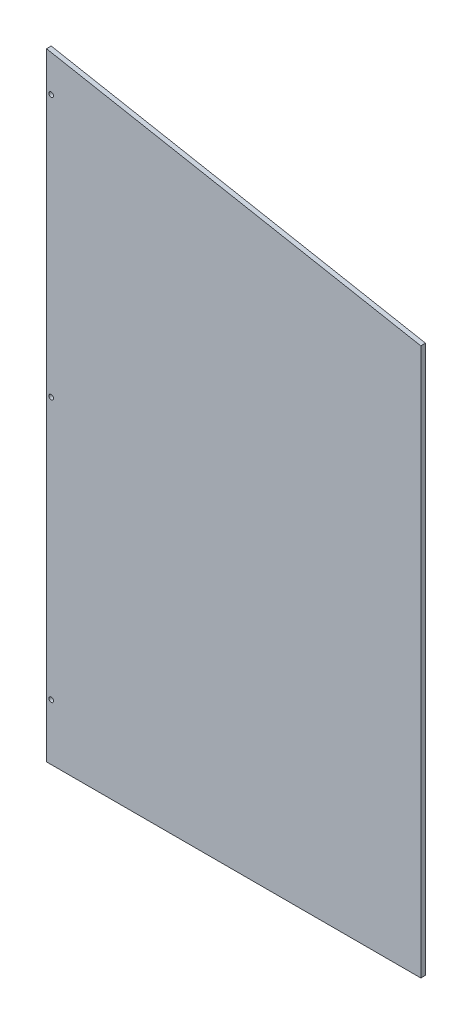
ISO-10303-21;
HEADER;
FILE_DESCRIPTION(('STEP AP214'),'2;1');
FILE_NAME('part.step','',(''),(''),'','','');
FILE_SCHEMA(('AUTOMOTIVE_DESIGN { 1 0 10303 214 1 1 1 1 }'));
ENDSEC;
DATA;
#1=APPLICATION_CONTEXT('core data for automotive mechanical design processes');
#2=APPLICATION_PROTOCOL_DEFINITION('international standard','automotive_design',2000,#1);
#3=PRODUCT_CONTEXT('',#1,'mechanical');
#4=PRODUCT('Part','Part','',(#3));
#5=PRODUCT_RELATED_PRODUCT_CATEGORY('part','',(#4));
#6=PRODUCT_DEFINITION_FORMATION('','',#4);
#7=PRODUCT_DEFINITION_CONTEXT('part definition',#1,'design');
#8=PRODUCT_DEFINITION('design','',#6,#7);
#9=PRODUCT_DEFINITION_SHAPE('','',#8);
#10=(LENGTH_UNIT() NAMED_UNIT(*) SI_UNIT(.MILLI.,.METRE.));
#11=(NAMED_UNIT(*) PLANE_ANGLE_UNIT() SI_UNIT($,.RADIAN.));
#12=(NAMED_UNIT(*) SI_UNIT($,.STERADIAN.) SOLID_ANGLE_UNIT());
#13=UNCERTAINTY_MEASURE_WITH_UNIT(LENGTH_MEASURE(1.E-05),#10,'distance_accuracy_value','');
#14=(GEOMETRIC_REPRESENTATION_CONTEXT(3) GLOBAL_UNCERTAINTY_ASSIGNED_CONTEXT((#13)) GLOBAL_UNIT_ASSIGNED_CONTEXT((#10,
#11,#12)) REPRESENTATION_CONTEXT('',''));
#15=CARTESIAN_POINT('',(0.,0.,0.));
#16=DIRECTION('',(0.,0.,1.));
#17=DIRECTION('',(1.,0.,0.));
#18=AXIS2_PLACEMENT_3D('',#15,#16,#17);
#19=CARTESIAN_POINT('',(0.,0.,0.));
#20=DIRECTION('',(0.,0.,1.));
#21=DIRECTION('',(1.,0.,0.));
#22=AXIS2_PLACEMENT_3D('',#19,#20,#21);
#23=PLANE('',#22);
#24=CARTESIAN_POINT('',(6.35,787.4,0.));
#25=DIRECTION('',(0.,0.,-1.));
#26=DIRECTION('',(-1.,0.,0.));
#27=AXIS2_PLACEMENT_3D('',#24,#25,#26);
#28=CIRCLE('',#27,3.175);
#29=CARTESIAN_POINT('',(3.175,787.4,0.));
#30=VERTEX_POINT('',#29);
#31=EDGE_CURVE('E87',#30,#30,#28,.F.);
#32=ORIENTED_EDGE('',*,*,#31,.T.);
#33=EDGE_LOOP('',(#32));
#34=FACE_BOUND('',#33,.T.);
#35=CARTESIAN_POINT('',(6.35,76.2,0.));
#36=DIRECTION('',(0.,0.,-1.));
#37=DIRECTION('',(-1.,0.,0.));
#38=AXIS2_PLACEMENT_3D('',#35,#36,#37);
#39=CIRCLE('',#38,3.175);
#40=CARTESIAN_POINT('',(3.175,76.2,0.));
#41=VERTEX_POINT('',#40);
#42=EDGE_CURVE('E90',#41,#41,#39,.F.);
#43=ORIENTED_EDGE('',*,*,#42,.T.);
#44=EDGE_LOOP('',(#43));
#45=FACE_BOUND('',#44,.T.);
#46=CARTESIAN_POINT('',(6.35,431.8,0.));
#47=DIRECTION('',(0.,0.,-1.));
#48=DIRECTION('',(-1.,0.,0.));
#49=AXIS2_PLACEMENT_3D('',#46,#47,#48);
#50=CIRCLE('',#49,3.175);
#51=CARTESIAN_POINT('',(3.175,431.8,0.));
#52=VERTEX_POINT('',#51);
#53=EDGE_CURVE('E20',#52,#52,#50,.F.);
#54=ORIENTED_EDGE('',*,*,#53,.T.);
#55=EDGE_LOOP('',(#54));
#56=FACE_BOUND('',#55,.T.);
#57=DIRECTION('',(1.,0.,0.));
#58=VECTOR('',#57,1.);
#59=CARTESIAN_POINT('',(0.,0.,0.));
#60=LINE('',#59,#58);
#61=CARTESIAN_POINT('',(0.,0.,0.));
#62=VERTEX_POINT('',#61);
#63=CARTESIAN_POINT('',(508.,0.,0.));
#64=VERTEX_POINT('',#63);
#65=EDGE_CURVE('E56',#62,#64,#60,.T.);
#66=ORIENTED_EDGE('',*,*,#65,.F.);
#67=DIRECTION('',(0.,1.,0.));
#68=VECTOR('',#67,1.);
#69=CARTESIAN_POINT('',(0.,838.2,0.));
#70=LINE('',#69,#68);
#71=CARTESIAN_POINT('',(4.44089209850063E-13,838.200000000002,0.));
#72=VERTEX_POINT('',#71);
#73=EDGE_CURVE('E61',#72,#62,#70,.F.);
#74=ORIENTED_EDGE('',*,*,#73,.F.);
#75=DIRECTION('',(0.982872186934319,-0.184288535050203,0.));
#76=VECTOR('',#75,1.);
#77=CARTESIAN_POINT('',(508.,742.95,0.));
#78=LINE('',#77,#76);
#79=CARTESIAN_POINT('',(508.,742.95,0.));
#80=VERTEX_POINT('',#79);
#81=EDGE_CURVE('E97',#72,#80,#78,.T.);
#82=ORIENTED_EDGE('',*,*,#81,.T.);
#83=DIRECTION('',(0.,1.,0.));
#84=VECTOR('',#83,1.);
#85=CARTESIAN_POINT('',(508.,0.,0.));
#86=LINE('',#85,#84);
#87=EDGE_CURVE('E70',#64,#80,#86,.T.);
#88=ORIENTED_EDGE('',*,*,#87,.F.);
#89=EDGE_LOOP('',(#66,#74,#82,#88));
#90=FACE_BOUND('',#89,.T.);
#91=ADVANCED_FACE('F17',(#34,#45,#56,#90),#23,.F.);
#92=CARTESIAN_POINT('',(0.,838.2,0.));
#93=DIRECTION('',(-1.,0.,0.));
#94=DIRECTION('',(0.,0.,1.));
#95=AXIS2_PLACEMENT_3D('',#92,#93,#94);
#96=PLANE('',#95);
#97=DIRECTION('',(0.,1.,0.));
#98=VECTOR('',#97,1.);
#99=CARTESIAN_POINT('',(0.,0.,6.35));
#100=LINE('',#99,#98);
#101=CARTESIAN_POINT('',(4.71844785465692E-13,838.200000000002,6.35));
#102=VERTEX_POINT('',#101);
#103=CARTESIAN_POINT('',(0.,0.,6.35));
#104=VERTEX_POINT('',#103);
#105=EDGE_CURVE('E89',#102,#104,#100,.F.);
#106=ORIENTED_EDGE('',*,*,#105,.F.);
#107=DIRECTION('',(0.,0.,1.));
#108=VECTOR('',#107,1.);
#109=CARTESIAN_POINT('',(1.77635683940025E-12,838.200000000009,0.));
#110=LINE('',#109,#108);
#111=EDGE_CURVE('E66',#102,#72,#110,.F.);
#112=ORIENTED_EDGE('',*,*,#111,.T.);
#113=ORIENTED_EDGE('',*,*,#73,.T.);
#114=DIRECTION('',(0.,0.,-1.));
#115=VECTOR('',#114,1.);
#116=CARTESIAN_POINT('',(0.,0.,0.));
#117=LINE('',#116,#115);
#118=EDGE_CURVE('E63',#104,#62,#117,.T.);
#119=ORIENTED_EDGE('',*,*,#118,.F.);
#120=EDGE_LOOP('',(#106,#112,#113,#119));
#121=FACE_BOUND('',#120,.T.);
#122=ADVANCED_FACE('F62',(#121),#96,.T.);
#123=CARTESIAN_POINT('',(0.,0.,0.));
#124=DIRECTION('',(0.,-1.,0.));
#125=DIRECTION('',(0.,0.,-1.));
#126=AXIS2_PLACEMENT_3D('',#123,#124,#125);
#127=PLANE('',#126);
#128=ORIENTED_EDGE('',*,*,#118,.T.);
#129=ORIENTED_EDGE('',*,*,#65,.T.);
#130=DIRECTION('',(0.,0.,-1.));
#131=VECTOR('',#130,1.);
#132=CARTESIAN_POINT('',(508.,0.,0.));
#133=LINE('',#132,#131);
#134=CARTESIAN_POINT('',(508.,0.,6.35));
#135=VERTEX_POINT('',#134);
#136=EDGE_CURVE('E72',#135,#64,#133,.T.);
#137=ORIENTED_EDGE('',*,*,#136,.F.);
#138=DIRECTION('',(1.,0.,0.));
#139=VECTOR('',#138,1.);
#140=CARTESIAN_POINT('',(0.,0.,6.35));
#141=LINE('',#140,#139);
#142=EDGE_CURVE('E76',#104,#135,#141,.T.);
#143=ORIENTED_EDGE('',*,*,#142,.F.);
#144=EDGE_LOOP('',(#128,#129,#137,#143));
#145=FACE_BOUND('',#144,.T.);
#146=ADVANCED_FACE('F74',(#145),#127,.T.);
#147=CARTESIAN_POINT('',(508.,0.,0.));
#148=DIRECTION('',(1.,0.,0.));
#149=DIRECTION('',(0.,0.,-1.));
#150=AXIS2_PLACEMENT_3D('',#147,#148,#149);
#151=PLANE('',#150);
#152=ORIENTED_EDGE('',*,*,#87,.T.);
#153=DIRECTION('',(0.,0.,1.));
#154=VECTOR('',#153,1.);
#155=CARTESIAN_POINT('',(508.,742.95,0.));
#156=LINE('',#155,#154);
#157=CARTESIAN_POINT('',(508.,742.95,6.35));
#158=VERTEX_POINT('',#157);
#159=EDGE_CURVE('E35',#80,#158,#156,.T.);
#160=ORIENTED_EDGE('',*,*,#159,.T.);
#161=DIRECTION('',(0.,1.,0.));
#162=VECTOR('',#161,1.);
#163=CARTESIAN_POINT('',(508.,0.,6.35));
#164=LINE('',#163,#162);
#165=EDGE_CURVE('E106',#135,#158,#164,.T.);
#166=ORIENTED_EDGE('',*,*,#165,.F.);
#167=ORIENTED_EDGE('',*,*,#136,.T.);
#168=EDGE_LOOP('',(#152,#160,#166,#167));
#169=FACE_BOUND('',#168,.T.);
#170=ADVANCED_FACE('F104',(#169),#151,.T.);
#171=CARTESIAN_POINT('',(508.,742.95,0.));
#172=DIRECTION('',(-0.184288535050203,-0.982872186934319,0.));
#173=DIRECTION('',(0.982872186934319,-0.184288535050203,0.));
#174=AXIS2_PLACEMENT_3D('',#171,#172,#173);
#175=PLANE('',#174);
#176=ORIENTED_EDGE('',*,*,#81,.F.);
#177=ORIENTED_EDGE('',*,*,#111,.F.);
#178=DIRECTION('',(-0.982872186934322,0.184288535050185,0.));
#179=VECTOR('',#178,1.);
#180=CARTESIAN_POINT('',(508.,742.95,6.35));
#181=LINE('',#180,#179);
#182=EDGE_CURVE('E86',#158,#102,#181,.T.);
#183=ORIENTED_EDGE('',*,*,#182,.F.);
#184=ORIENTED_EDGE('',*,*,#159,.F.);
#185=EDGE_LOOP('',(#176,#177,#183,#184));
#186=FACE_BOUND('',#185,.T.);
#187=ADVANCED_FACE('F113',(#186),#175,.F.);
#188=CARTESIAN_POINT('',(6.35,431.8,6.35));
#189=DIRECTION('',(0.,0.,-1.));
#190=DIRECTION('',(-1.,0.,0.));
#191=AXIS2_PLACEMENT_3D('',#188,#189,#190);
#192=CYLINDRICAL_SURFACE('',#191,3.175);
#193=CARTESIAN_POINT('',(6.35,431.8,6.35));
#194=DIRECTION('',(0.,0.,-1.));
#195=DIRECTION('',(-1.,0.,0.));
#196=AXIS2_PLACEMENT_3D('',#193,#194,#195);
#197=CIRCLE('',#196,3.175);
#198=CARTESIAN_POINT('',(3.175,431.8,6.35));
#199=VERTEX_POINT('',#198);
#200=EDGE_CURVE('E83',#199,#199,#197,.T.);
#201=ORIENTED_EDGE('',*,*,#200,.F.);
#202=EDGE_LOOP('',(#201));
#203=FACE_BOUND('',#202,.T.);
#204=ORIENTED_EDGE('',*,*,#53,.F.);
#205=EDGE_LOOP('',(#204));
#206=FACE_BOUND('',#205,.T.);
#207=ADVANCED_FACE('F115',(#203,#206),#192,.F.);
#208=CARTESIAN_POINT('',(6.35,76.2,6.35));
#209=DIRECTION('',(0.,0.,-1.));
#210=DIRECTION('',(-1.,0.,0.));
#211=AXIS2_PLACEMENT_3D('',#208,#209,#210);
#212=CYLINDRICAL_SURFACE('',#211,3.175);
#213=CARTESIAN_POINT('',(6.35,76.2,6.35));
#214=DIRECTION('',(0.,0.,-1.));
#215=DIRECTION('',(-1.,0.,0.));
#216=AXIS2_PLACEMENT_3D('',#213,#214,#215);
#217=CIRCLE('',#216,3.175);
#218=CARTESIAN_POINT('',(3.175,76.2,6.35));
#219=VERTEX_POINT('',#218);
#220=EDGE_CURVE('E26',#219,#219,#217,.T.);
#221=ORIENTED_EDGE('',*,*,#220,.F.);
#222=EDGE_LOOP('',(#221));
#223=FACE_BOUND('',#222,.T.);
#224=ORIENTED_EDGE('',*,*,#42,.F.);
#225=EDGE_LOOP('',(#224));
#226=FACE_BOUND('',#225,.T.);
#227=ADVANCED_FACE('F122',(#223,#226),#212,.F.);
#228=CARTESIAN_POINT('',(6.35,787.4,6.35));
#229=DIRECTION('',(0.,0.,-1.));
#230=DIRECTION('',(-1.,0.,0.));
#231=AXIS2_PLACEMENT_3D('',#228,#229,#230);
#232=CYLINDRICAL_SURFACE('',#231,3.175);
#233=CARTESIAN_POINT('',(6.35,787.4,6.35));
#234=DIRECTION('',(0.,0.,-1.));
#235=DIRECTION('',(-1.,0.,0.));
#236=AXIS2_PLACEMENT_3D('',#233,#234,#235);
#237=CIRCLE('',#236,3.175);
#238=CARTESIAN_POINT('',(3.175,787.4,6.35));
#239=VERTEX_POINT('',#238);
#240=EDGE_CURVE('E11',#239,#239,#237,.T.);
#241=ORIENTED_EDGE('',*,*,#240,.F.);
#242=EDGE_LOOP('',(#241));
#243=FACE_BOUND('',#242,.T.);
#244=ORIENTED_EDGE('',*,*,#31,.F.);
#245=EDGE_LOOP('',(#244));
#246=FACE_BOUND('',#245,.T.);
#247=ADVANCED_FACE('F127',(#243,#246),#232,.F.);
#248=CARTESIAN_POINT('',(0.,0.,6.35));
#249=DIRECTION('',(0.,0.,1.));
#250=DIRECTION('',(1.,0.,0.));
#251=AXIS2_PLACEMENT_3D('',#248,#249,#250);
#252=PLANE('',#251);
#253=ORIENTED_EDGE('',*,*,#240,.T.);
#254=EDGE_LOOP('',(#253));
#255=FACE_BOUND('',#254,.T.);
#256=ORIENTED_EDGE('',*,*,#220,.T.);
#257=EDGE_LOOP('',(#256));
#258=FACE_BOUND('',#257,.T.);
#259=ORIENTED_EDGE('',*,*,#200,.T.);
#260=EDGE_LOOP('',(#259));
#261=FACE_BOUND('',#260,.T.);
#262=ORIENTED_EDGE('',*,*,#165,.T.);
#263=ORIENTED_EDGE('',*,*,#182,.T.);
#264=ORIENTED_EDGE('',*,*,#105,.T.);
#265=ORIENTED_EDGE('',*,*,#142,.T.);
#266=EDGE_LOOP('',(#262,#263,#264,#265));
#267=FACE_BOUND('',#266,.T.);
#268=ADVANCED_FACE('F110',(#255,#258,#261,#267),#252,.T.);
#269=CLOSED_SHELL('',(#91,#122,#146,#170,#187,#207,#227,#247,#268));
#270=MANIFOLD_SOLID_BREP('B1',#269);
#271=ADVANCED_BREP_SHAPE_REPRESENTATION('',(#18,#270),#14);
#272=SHAPE_DEFINITION_REPRESENTATION(#9,#271);
ENDSEC;
END-ISO-10303-21;
